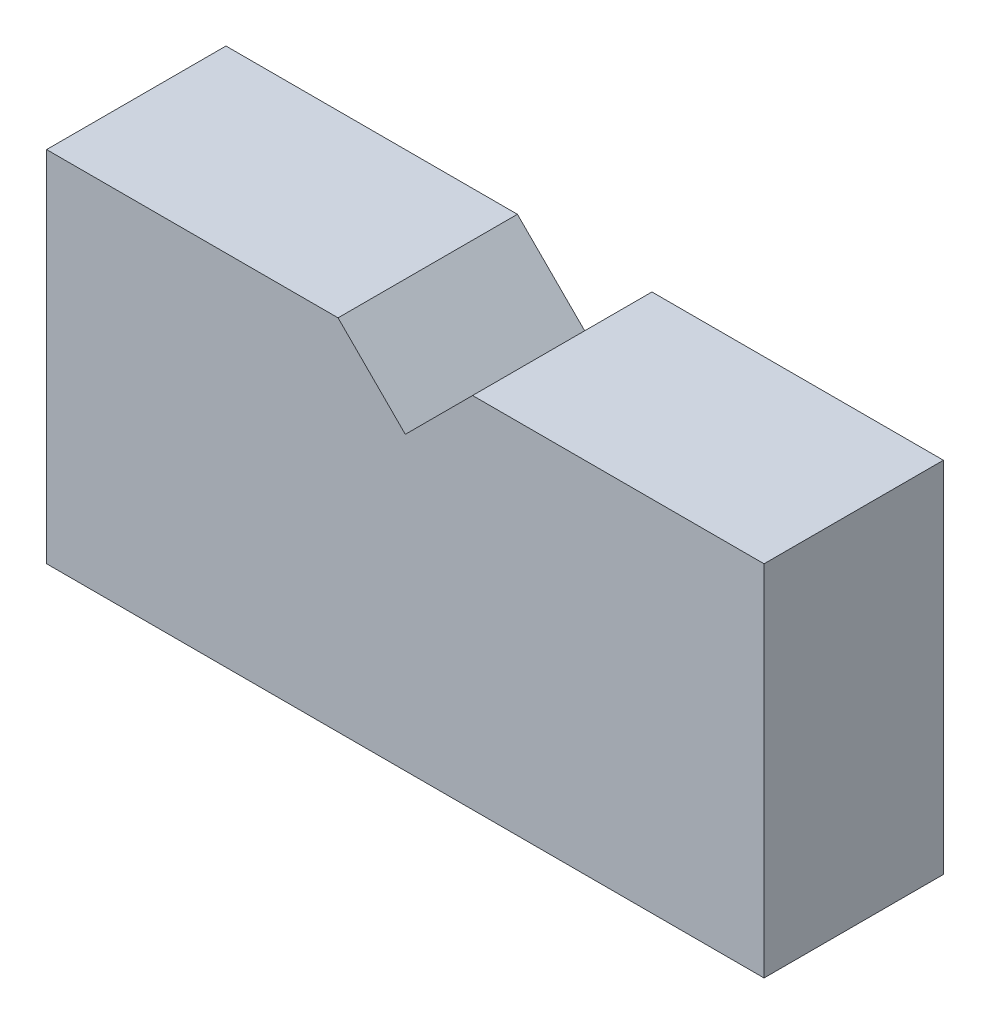
ISO-10303-21;
HEADER;
FILE_DESCRIPTION(('STEP AP214'),'2;1');
FILE_NAME('part.step','',(''),(''),'','','');
FILE_SCHEMA(('AUTOMOTIVE_DESIGN { 1 0 10303 214 1 1 1 1 }'));
ENDSEC;
DATA;
#1=APPLICATION_CONTEXT('core data for automotive mechanical design processes');
#2=APPLICATION_PROTOCOL_DEFINITION('international standard','automotive_design',2000,#1);
#3=PRODUCT_CONTEXT('',#1,'mechanical');
#4=PRODUCT('Part','Part','',(#3));
#5=PRODUCT_RELATED_PRODUCT_CATEGORY('part','',(#4));
#6=PRODUCT_DEFINITION_FORMATION('','',#4);
#7=PRODUCT_DEFINITION_CONTEXT('part definition',#1,'design');
#8=PRODUCT_DEFINITION('design','',#6,#7);
#9=PRODUCT_DEFINITION_SHAPE('','',#8);
#10=(LENGTH_UNIT() NAMED_UNIT(*) SI_UNIT(.MILLI.,.METRE.));
#11=(NAMED_UNIT(*) PLANE_ANGLE_UNIT() SI_UNIT($,.RADIAN.));
#12=(NAMED_UNIT(*) SI_UNIT($,.STERADIAN.) SOLID_ANGLE_UNIT());
#13=UNCERTAINTY_MEASURE_WITH_UNIT(LENGTH_MEASURE(1.E-05),#10,'distance_accuracy_value','');
#14=(GEOMETRIC_REPRESENTATION_CONTEXT(3) GLOBAL_UNCERTAINTY_ASSIGNED_CONTEXT((#13)) GLOBAL_UNIT_ASSIGNED_CONTEXT((#10,
#11,#12)) REPRESENTATION_CONTEXT('',''));
#15=CARTESIAN_POINT('',(0.,0.,0.));
#16=DIRECTION('',(0.,0.,1.));
#17=DIRECTION('',(1.,0.,0.));
#18=AXIS2_PLACEMENT_3D('',#15,#16,#17);
#19=CARTESIAN_POINT('',(0.,0.,25.4));
#20=DIRECTION('',(1.,0.,0.));
#21=DIRECTION('',(0.,0.,-1.));
#22=AXIS2_PLACEMENT_3D('',#19,#20,#21);
#23=PLANE('',#22);
#24=DIRECTION('',(0.,-1.,0.));
#25=VECTOR('',#24,1.);
#26=CARTESIAN_POINT('',(0.,0.,-25.4));
#27=LINE('',#26,#25);
#28=CARTESIAN_POINT('',(0.,101.6,-25.4));
#29=VERTEX_POINT('',#28);
#30=CARTESIAN_POINT('',(0.,0.,-25.4));
#31=VERTEX_POINT('',#30);
#32=EDGE_CURVE('E138',#29,#31,#27,.T.);
#33=ORIENTED_EDGE('',*,*,#32,.T.);
#34=DIRECTION('',(0.,0.,-1.));
#35=VECTOR('',#34,1.);
#36=CARTESIAN_POINT('',(0.,0.,25.4));
#37=LINE('',#36,#35);
#38=CARTESIAN_POINT('',(0.,0.,25.4));
#39=VERTEX_POINT('',#38);
#40=EDGE_CURVE('E11',#39,#31,#37,.T.);
#41=ORIENTED_EDGE('',*,*,#40,.F.);
#42=DIRECTION('',(0.,-1.,0.));
#43=VECTOR('',#42,1.);
#44=CARTESIAN_POINT('',(0.,0.,25.4));
#45=LINE('',#44,#43);
#46=CARTESIAN_POINT('',(0.,101.6,25.4));
#47=VERTEX_POINT('',#46);
#48=EDGE_CURVE('E157',#47,#39,#45,.T.);
#49=ORIENTED_EDGE('',*,*,#48,.F.);
#50=DIRECTION('',(0.,0.,-1.));
#51=VECTOR('',#50,1.);
#52=CARTESIAN_POINT('',(0.,101.6,25.4));
#53=LINE('',#52,#51);
#54=EDGE_CURVE('E134',#47,#29,#53,.T.);
#55=ORIENTED_EDGE('',*,*,#54,.T.);
#56=EDGE_LOOP('',(#33,#41,#49,#55));
#57=FACE_BOUND('',#56,.T.);
#58=ADVANCED_FACE('F43',(#57),#23,.F.);
#59=CARTESIAN_POINT('',(0.,0.,25.4));
#60=DIRECTION('',(0.,1.,0.));
#61=DIRECTION('',(0.,0.,1.));
#62=AXIS2_PLACEMENT_3D('',#59,#60,#61);
#63=PLANE('',#62);
#64=DIRECTION('',(1.,0.,0.));
#65=VECTOR('',#64,1.);
#66=CARTESIAN_POINT('',(0.,0.,-25.4));
#67=LINE('',#66,#65);
#68=CARTESIAN_POINT('',(203.2,0.,-25.4));
#69=VERTEX_POINT('',#68);
#70=EDGE_CURVE('E142',#31,#69,#67,.T.);
#71=ORIENTED_EDGE('',*,*,#70,.T.);
#72=DIRECTION('',(0.,0.,-1.));
#73=VECTOR('',#72,1.);
#74=CARTESIAN_POINT('',(203.2,0.,25.4));
#75=LINE('',#74,#73);
#76=CARTESIAN_POINT('',(203.2,0.,25.4));
#77=VERTEX_POINT('',#76);
#78=EDGE_CURVE('E52',#77,#69,#75,.T.);
#79=ORIENTED_EDGE('',*,*,#78,.F.);
#80=DIRECTION('',(1.,0.,0.));
#81=VECTOR('',#80,1.);
#82=CARTESIAN_POINT('',(0.,0.,25.4));
#83=LINE('',#82,#81);
#84=EDGE_CURVE('E100',#39,#77,#83,.T.);
#85=ORIENTED_EDGE('',*,*,#84,.F.);
#86=ORIENTED_EDGE('',*,*,#40,.T.);
#87=EDGE_LOOP('',(#71,#79,#85,#86));
#88=FACE_BOUND('',#87,.T.);
#89=ADVANCED_FACE('F191',(#88),#63,.F.);
#90=CARTESIAN_POINT('',(203.2,0.,25.4));
#91=DIRECTION('',(-1.,0.,0.));
#92=DIRECTION('',(0.,0.,1.));
#93=AXIS2_PLACEMENT_3D('',#90,#91,#92);
#94=PLANE('',#93);
#95=DIRECTION('',(0.,1.,0.));
#96=VECTOR('',#95,1.);
#97=CARTESIAN_POINT('',(203.2,0.,-25.4));
#98=LINE('',#97,#96);
#99=CARTESIAN_POINT('',(203.2,101.6,-25.4));
#100=VERTEX_POINT('',#99);
#101=EDGE_CURVE('E145',#69,#100,#98,.T.);
#102=ORIENTED_EDGE('',*,*,#101,.T.);
#103=DIRECTION('',(0.,0.,-1.));
#104=VECTOR('',#103,1.);
#105=CARTESIAN_POINT('',(203.2,101.6,25.4));
#106=LINE('',#105,#104);
#107=CARTESIAN_POINT('',(203.2,101.6,25.4));
#108=VERTEX_POINT('',#107);
#109=EDGE_CURVE('E164',#108,#100,#106,.T.);
#110=ORIENTED_EDGE('',*,*,#109,.F.);
#111=DIRECTION('',(0.,1.,0.));
#112=VECTOR('',#111,1.);
#113=CARTESIAN_POINT('',(203.2,0.,25.4));
#114=LINE('',#113,#112);
#115=EDGE_CURVE('E174',#77,#108,#114,.T.);
#116=ORIENTED_EDGE('',*,*,#115,.F.);
#117=ORIENTED_EDGE('',*,*,#78,.T.);
#118=EDGE_LOOP('',(#102,#110,#116,#117));
#119=FACE_BOUND('',#118,.T.);
#120=ADVANCED_FACE('F172',(#119),#94,.F.);
#121=CARTESIAN_POINT('',(120.65,101.6,25.4));
#122=DIRECTION('',(0.,-1.,0.));
#123=DIRECTION('',(0.,0.,-1.));
#124=AXIS2_PLACEMENT_3D('',#121,#122,#123);
#125=PLANE('',#124);
#126=DIRECTION('',(-1.,0.,0.));
#127=VECTOR('',#126,1.);
#128=CARTESIAN_POINT('',(120.65,101.6,-25.4));
#129=LINE('',#128,#127);
#130=CARTESIAN_POINT('',(120.65,101.6,-25.4));
#131=VERTEX_POINT('',#130);
#132=EDGE_CURVE('E148',#100,#131,#129,.T.);
#133=ORIENTED_EDGE('',*,*,#132,.T.);
#134=DIRECTION('',(0.,0.,-1.));
#135=VECTOR('',#134,1.);
#136=CARTESIAN_POINT('',(120.65,101.6,25.4));
#137=LINE('',#136,#135);
#138=CARTESIAN_POINT('',(120.65,101.6,25.4));
#139=VERTEX_POINT('',#138);
#140=EDGE_CURVE('E127',#139,#131,#137,.T.);
#141=ORIENTED_EDGE('',*,*,#140,.F.);
#142=DIRECTION('',(-1.,0.,0.));
#143=VECTOR('',#142,1.);
#144=CARTESIAN_POINT('',(120.65,101.6,25.4));
#145=LINE('',#144,#143);
#146=EDGE_CURVE('E116',#108,#139,#145,.T.);
#147=ORIENTED_EDGE('',*,*,#146,.F.);
#148=ORIENTED_EDGE('',*,*,#109,.T.);
#149=EDGE_LOOP('',(#133,#141,#147,#148));
#150=FACE_BOUND('',#149,.T.);
#151=ADVANCED_FACE('F180',(#150),#125,.F.);
#152=CARTESIAN_POINT('',(101.6,82.55,25.4));
#153=DIRECTION('',(0.707106781186548,-0.707106781186547,0.));
#154=DIRECTION('',(0.707106781186547,0.707106781186548,0.));
#155=AXIS2_PLACEMENT_3D('',#152,#153,#154);
#156=PLANE('',#155);
#157=DIRECTION('',(-0.707106781186547,-0.707106781186548,0.));
#158=VECTOR('',#157,1.);
#159=CARTESIAN_POINT('',(101.6,82.55,-25.4));
#160=LINE('',#159,#158);
#161=CARTESIAN_POINT('',(101.6,82.55,-25.4));
#162=VERTEX_POINT('',#161);
#163=EDGE_CURVE('E125',#131,#162,#160,.T.);
#164=ORIENTED_EDGE('',*,*,#163,.T.);
#165=DIRECTION('',(0.,0.,-1.));
#166=VECTOR('',#165,1.);
#167=CARTESIAN_POINT('',(101.6,82.55,25.4));
#168=LINE('',#167,#166);
#169=CARTESIAN_POINT('',(101.6,82.55,25.4));
#170=VERTEX_POINT('',#169);
#171=EDGE_CURVE('E122',#170,#162,#168,.T.);
#172=ORIENTED_EDGE('',*,*,#171,.F.);
#173=DIRECTION('',(-0.707106781186547,-0.707106781186548,0.));
#174=VECTOR('',#173,1.);
#175=CARTESIAN_POINT('',(101.6,82.55,25.4));
#176=LINE('',#175,#174);
#177=EDGE_CURVE('E110',#139,#170,#176,.T.);
#178=ORIENTED_EDGE('',*,*,#177,.F.);
#179=ORIENTED_EDGE('',*,*,#140,.T.);
#180=EDGE_LOOP('',(#164,#172,#178,#179));
#181=FACE_BOUND('',#180,.T.);
#182=ADVANCED_FACE('F123',(#181),#156,.F.);
#183=CARTESIAN_POINT('',(82.55,101.6,25.4));
#184=DIRECTION('',(-0.707106781186548,-0.707106781186547,0.));
#185=DIRECTION('',(0.707106781186547,-0.707106781186548,0.));
#186=AXIS2_PLACEMENT_3D('',#183,#184,#185);
#187=PLANE('',#186);
#188=DIRECTION('',(-0.707106781186547,0.707106781186548,0.));
#189=VECTOR('',#188,1.);
#190=CARTESIAN_POINT('',(82.55,101.6,-25.4));
#191=LINE('',#190,#189);
#192=CARTESIAN_POINT('',(82.55,101.6,-25.4));
#193=VERTEX_POINT('',#192);
#194=EDGE_CURVE('E86',#162,#193,#191,.T.);
#195=ORIENTED_EDGE('',*,*,#194,.T.);
#196=DIRECTION('',(0.,0.,-1.));
#197=VECTOR('',#196,1.);
#198=CARTESIAN_POINT('',(82.55,101.6,25.4));
#199=LINE('',#198,#197);
#200=CARTESIAN_POINT('',(82.55,101.6,25.4));
#201=VERTEX_POINT('',#200);
#202=EDGE_CURVE('E128',#201,#193,#199,.T.);
#203=ORIENTED_EDGE('',*,*,#202,.F.);
#204=DIRECTION('',(-0.707106781186547,0.707106781186548,0.));
#205=VECTOR('',#204,1.);
#206=CARTESIAN_POINT('',(82.55,101.6,25.4));
#207=LINE('',#206,#205);
#208=EDGE_CURVE('E114',#170,#201,#207,.T.);
#209=ORIENTED_EDGE('',*,*,#208,.F.);
#210=ORIENTED_EDGE('',*,*,#171,.T.);
#211=EDGE_LOOP('',(#195,#203,#209,#210));
#212=FACE_BOUND('',#211,.T.);
#213=ADVANCED_FACE('F130',(#212),#187,.F.);
#214=CARTESIAN_POINT('',(0.,101.6,25.4));
#215=DIRECTION('',(0.,-1.,0.));
#216=DIRECTION('',(0.,0.,-1.));
#217=AXIS2_PLACEMENT_3D('',#214,#215,#216);
#218=PLANE('',#217);
#219=DIRECTION('',(-1.,0.,0.));
#220=VECTOR('',#219,1.);
#221=CARTESIAN_POINT('',(0.,101.6,-25.4));
#222=LINE('',#221,#220);
#223=EDGE_CURVE('E92',#193,#29,#222,.T.);
#224=ORIENTED_EDGE('',*,*,#223,.T.);
#225=ORIENTED_EDGE('',*,*,#54,.F.);
#226=DIRECTION('',(-1.,0.,0.));
#227=VECTOR('',#226,1.);
#228=CARTESIAN_POINT('',(0.,101.6,25.4));
#229=LINE('',#228,#227);
#230=EDGE_CURVE('E60',#201,#47,#229,.T.);
#231=ORIENTED_EDGE('',*,*,#230,.F.);
#232=ORIENTED_EDGE('',*,*,#202,.T.);
#233=EDGE_LOOP('',(#224,#225,#231,#232));
#234=FACE_BOUND('',#233,.T.);
#235=ADVANCED_FACE('F205',(#234),#218,.F.);
#236=CARTESIAN_POINT('',(0.,0.,25.4));
#237=DIRECTION('',(0.,0.,-1.));
#238=DIRECTION('',(-1.,0.,0.));
#239=AXIS2_PLACEMENT_3D('',#236,#237,#238);
#240=PLANE('',#239);
#241=ORIENTED_EDGE('',*,*,#48,.T.);
#242=ORIENTED_EDGE('',*,*,#84,.T.);
#243=ORIENTED_EDGE('',*,*,#115,.T.);
#244=ORIENTED_EDGE('',*,*,#146,.T.);
#245=ORIENTED_EDGE('',*,*,#177,.T.);
#246=ORIENTED_EDGE('',*,*,#208,.T.);
#247=ORIENTED_EDGE('',*,*,#230,.T.);
#248=EDGE_LOOP('',(#241,#242,#243,#244,#245,#246,#247));
#249=FACE_BOUND('',#248,.T.);
#250=ADVANCED_FACE('F112',(#249),#240,.F.);
#251=CARTESIAN_POINT('',(0.,0.,-25.4));
#252=DIRECTION('',(0.,0.,-1.));
#253=DIRECTION('',(-1.,0.,0.));
#254=AXIS2_PLACEMENT_3D('',#251,#252,#253);
#255=PLANE('',#254);
#256=ORIENTED_EDGE('',*,*,#32,.F.);
#257=ORIENTED_EDGE('',*,*,#223,.F.);
#258=ORIENTED_EDGE('',*,*,#194,.F.);
#259=ORIENTED_EDGE('',*,*,#163,.F.);
#260=ORIENTED_EDGE('',*,*,#132,.F.);
#261=ORIENTED_EDGE('',*,*,#101,.F.);
#262=ORIENTED_EDGE('',*,*,#70,.F.);
#263=EDGE_LOOP('',(#256,#257,#258,#259,#260,#261,#262));
#264=FACE_BOUND('',#263,.T.);
#265=ADVANCED_FACE('F178',(#264),#255,.T.);
#266=CLOSED_SHELL('',(#58,#89,#120,#151,#182,#213,#235,#250,#265));
#267=MANIFOLD_SOLID_BREP('B2',#266);
#268=ADVANCED_BREP_SHAPE_REPRESENTATION('',(#18,#267),#14);
#269=SHAPE_DEFINITION_REPRESENTATION(#9,#268);
ENDSEC;
END-ISO-10303-21;
